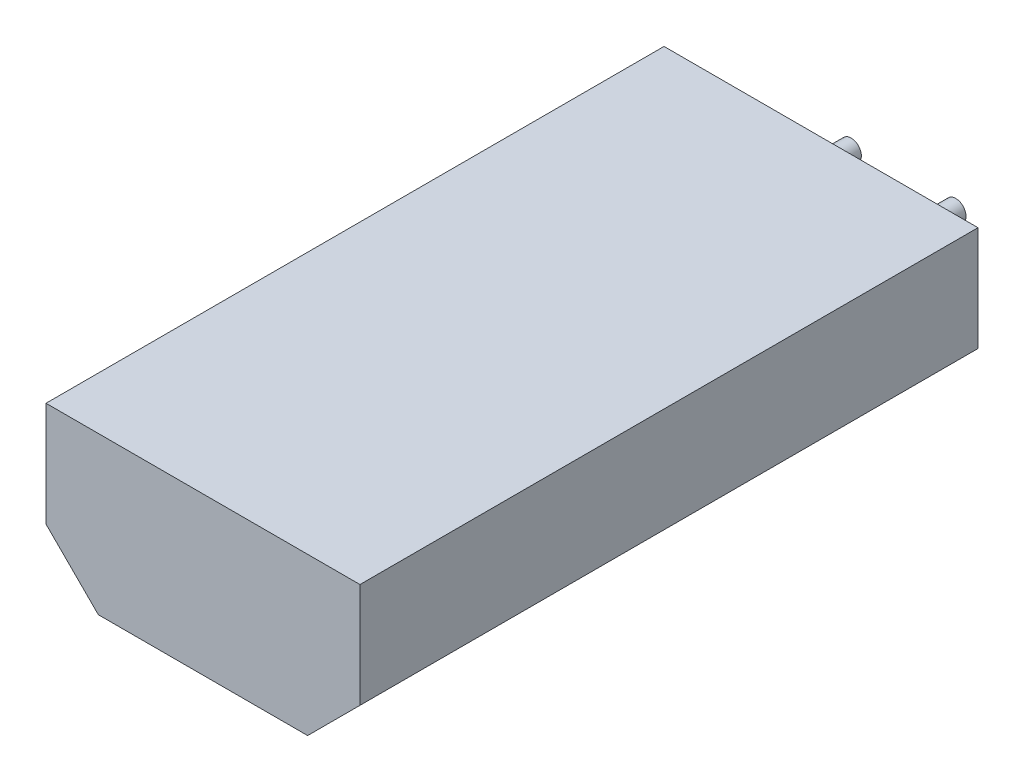
ISO-10303-21;
HEADER;
FILE_DESCRIPTION(('STEP AP214'),'2;1');
FILE_NAME('part.step','',(''),(''),'','','');
FILE_SCHEMA(('AUTOMOTIVE_DESIGN { 1 0 10303 214 1 1 1 1 }'));
ENDSEC;
DATA;
#1=APPLICATION_CONTEXT('core data for automotive mechanical design processes');
#2=APPLICATION_PROTOCOL_DEFINITION('international standard','automotive_design',2000,#1);
#3=PRODUCT_CONTEXT('',#1,'mechanical');
#4=PRODUCT('Part','Part','',(#3));
#5=PRODUCT_RELATED_PRODUCT_CATEGORY('part','',(#4));
#6=PRODUCT_DEFINITION_FORMATION('','',#4);
#7=PRODUCT_DEFINITION_CONTEXT('part definition',#1,'design');
#8=PRODUCT_DEFINITION('design','',#6,#7);
#9=PRODUCT_DEFINITION_SHAPE('','',#8);
#10=(LENGTH_UNIT() NAMED_UNIT(*) SI_UNIT(.MILLI.,.METRE.));
#11=(NAMED_UNIT(*) PLANE_ANGLE_UNIT() SI_UNIT($,.RADIAN.));
#12=(NAMED_UNIT(*) SI_UNIT($,.STERADIAN.) SOLID_ANGLE_UNIT());
#13=UNCERTAINTY_MEASURE_WITH_UNIT(LENGTH_MEASURE(1.E-05),#10,'distance_accuracy_value','');
#14=(GEOMETRIC_REPRESENTATION_CONTEXT(3) GLOBAL_UNCERTAINTY_ASSIGNED_CONTEXT((#13)) GLOBAL_UNIT_ASSIGNED_CONTEXT((#10,
#11,#12)) REPRESENTATION_CONTEXT('',''));
#15=CARTESIAN_POINT('',(0.,0.,0.));
#16=DIRECTION('',(0.,0.,1.));
#17=DIRECTION('',(1.,0.,0.));
#18=AXIS2_PLACEMENT_3D('',#15,#16,#17);
#19=CARTESIAN_POINT('',(2.54,0.,-2.));
#20=DIRECTION('',(0.,0.,1.));
#21=DIRECTION('',(1.,0.,0.));
#22=AXIS2_PLACEMENT_3D('',#19,#20,#21);
#23=CYLINDRICAL_SURFACE('',#22,0.25);
#24=CARTESIAN_POINT('',(2.54,0.,-2.));
#25=DIRECTION('',(0.,0.,1.));
#26=DIRECTION('',(1.,0.,0.));
#27=AXIS2_PLACEMENT_3D('',#24,#25,#26);
#28=CIRCLE('',#27,0.25);
#29=CARTESIAN_POINT('',(2.79,0.,-2.));
#30=VERTEX_POINT('',#29);
#31=EDGE_CURVE('E11',#30,#30,#28,.T.);
#32=ORIENTED_EDGE('',*,*,#31,.T.);
#33=EDGE_LOOP('',(#32));
#34=FACE_BOUND('',#33,.T.);
#35=CARTESIAN_POINT('',(2.54,0.,0.));
#36=DIRECTION('',(0.,0.,1.));
#37=DIRECTION('',(1.,0.,0.));
#38=AXIS2_PLACEMENT_3D('',#35,#36,#37);
#39=CIRCLE('',#38,0.25);
#40=CARTESIAN_POINT('',(2.79,0.,0.));
#41=VERTEX_POINT('',#40);
#42=EDGE_CURVE('E43',#41,#41,#39,.T.);
#43=ORIENTED_EDGE('',*,*,#42,.F.);
#44=EDGE_LOOP('',(#43));
#45=FACE_BOUND('',#44,.T.);
#46=ADVANCED_FACE('F40',(#34,#45),#23,.T.);
#47=CARTESIAN_POINT('',(2.54,0.,-2.));
#48=DIRECTION('',(0.,0.,1.));
#49=DIRECTION('',(1.,0.,0.));
#50=AXIS2_PLACEMENT_3D('',#47,#48,#49);
#51=PLANE('',#50);
#52=ORIENTED_EDGE('',*,*,#31,.F.);
#53=EDGE_LOOP('',(#52));
#54=FACE_BOUND('',#53,.T.);
#55=ADVANCED_FACE('F55',(#54),#51,.F.);
#56=CARTESIAN_POINT('',(2.54,0.,0.));
#57=DIRECTION('',(0.,0.,1.));
#58=DIRECTION('',(1.,0.,0.));
#59=AXIS2_PLACEMENT_3D('',#56,#57,#58);
#60=PLANE('',#59);
#61=ORIENTED_EDGE('',*,*,#42,.T.);
#62=EDGE_LOOP('',(#61));
#63=FACE_BOUND('',#62,.T.);
#64=ADVANCED_FACE('F52',(#63),#60,.T.);
#65=CLOSED_SHELL('',(#46,#55,#64));
#66=MANIFOLD_SOLID_BREP('B2',#65);
#67=CARTESIAN_POINT('',(0.,0.,-2.));
#68=DIRECTION('',(0.,0.,1.));
#69=DIRECTION('',(1.,0.,0.));
#70=AXIS2_PLACEMENT_3D('',#67,#68,#69);
#71=CYLINDRICAL_SURFACE('',#70,0.25);
#72=CARTESIAN_POINT('',(0.,0.,-2.));
#73=DIRECTION('',(0.,0.,1.));
#74=DIRECTION('',(1.,0.,0.));
#75=AXIS2_PLACEMENT_3D('',#72,#73,#74);
#76=CIRCLE('',#75,0.25);
#77=CARTESIAN_POINT('',(0.25,0.,-2.));
#78=VERTEX_POINT('',#77);
#79=EDGE_CURVE('E39',#78,#78,#76,.T.);
#80=ORIENTED_EDGE('',*,*,#79,.T.);
#81=EDGE_LOOP('',(#80));
#82=FACE_BOUND('',#81,.T.);
#83=CARTESIAN_POINT('',(0.,0.,0.));
#84=DIRECTION('',(0.,0.,1.));
#85=DIRECTION('',(1.,0.,0.));
#86=AXIS2_PLACEMENT_3D('',#83,#84,#85);
#87=CIRCLE('',#86,0.25);
#88=CARTESIAN_POINT('',(0.25,0.,0.));
#89=VERTEX_POINT('',#88);
#90=EDGE_CURVE('E93',#89,#89,#87,.T.);
#91=ORIENTED_EDGE('',*,*,#90,.F.);
#92=EDGE_LOOP('',(#91));
#93=FACE_BOUND('',#92,.T.);
#94=ADVANCED_FACE('F90',(#82,#93),#71,.T.);
#95=CARTESIAN_POINT('',(0.,0.,-2.));
#96=DIRECTION('',(0.,0.,1.));
#97=DIRECTION('',(1.,0.,0.));
#98=AXIS2_PLACEMENT_3D('',#95,#96,#97);
#99=PLANE('',#98);
#100=ORIENTED_EDGE('',*,*,#79,.F.);
#101=EDGE_LOOP('',(#100));
#102=FACE_BOUND('',#101,.T.);
#103=ADVANCED_FACE('F105',(#102),#99,.F.);
#104=CARTESIAN_POINT('',(0.,0.,0.));
#105=DIRECTION('',(0.,0.,1.));
#106=DIRECTION('',(1.,0.,0.));
#107=AXIS2_PLACEMENT_3D('',#104,#105,#106);
#108=PLANE('',#107);
#109=ORIENTED_EDGE('',*,*,#90,.T.);
#110=EDGE_LOOP('',(#109));
#111=FACE_BOUND('',#110,.T.);
#112=ADVANCED_FACE('F102',(#111),#108,.T.);
#113=CLOSED_SHELL('',(#94,#103,#112));
#114=MANIFOLD_SOLID_BREP('B6',#113);
#115=CARTESIAN_POINT('',(5.08,1.905,15.));
#116=DIRECTION('',(0.,-1.,0.));
#117=DIRECTION('',(0.,0.,-1.));
#118=AXIS2_PLACEMENT_3D('',#115,#116,#117);
#119=PLANE('',#118);
#120=DIRECTION('',(-1.,0.,0.));
#121=VECTOR('',#120,1.);
#122=CARTESIAN_POINT('',(5.08,1.905,0.));
#123=LINE('',#122,#121);
#124=CARTESIAN_POINT('',(5.08,1.905,0.));
#125=VERTEX_POINT('',#124);
#126=CARTESIAN_POINT('',(-2.54,1.905,0.));
#127=VERTEX_POINT('',#126);
#128=EDGE_CURVE('E215',#125,#127,#123,.T.);
#129=ORIENTED_EDGE('',*,*,#128,.T.);
#130=DIRECTION('',(0.,0.,-1.));
#131=VECTOR('',#130,1.);
#132=CARTESIAN_POINT('',(-2.54,1.905,15.));
#133=LINE('',#132,#131);
#134=CARTESIAN_POINT('',(-2.54,1.905,15.));
#135=VERTEX_POINT('',#134);
#136=EDGE_CURVE('E88',#135,#127,#133,.T.);
#137=ORIENTED_EDGE('',*,*,#136,.F.);
#138=DIRECTION('',(-1.,0.,0.));
#139=VECTOR('',#138,1.);
#140=CARTESIAN_POINT('',(5.08,1.905,15.));
#141=LINE('',#140,#139);
#142=CARTESIAN_POINT('',(5.08,1.905,15.));
#143=VERTEX_POINT('',#142);
#144=EDGE_CURVE('E225',#143,#135,#141,.T.);
#145=ORIENTED_EDGE('',*,*,#144,.F.);
#146=DIRECTION('',(0.,0.,-1.));
#147=VECTOR('',#146,1.);
#148=CARTESIAN_POINT('',(5.08,1.905,15.));
#149=LINE('',#148,#147);
#150=EDGE_CURVE('E211',#143,#125,#149,.T.);
#151=ORIENTED_EDGE('',*,*,#150,.T.);
#152=EDGE_LOOP('',(#129,#137,#145,#151));
#153=FACE_BOUND('',#152,.T.);
#154=ADVANCED_FACE('F131',(#153),#119,.F.);
#155=CARTESIAN_POINT('',(-2.54,1.905,15.));
#156=DIRECTION('',(1.,0.,0.));
#157=DIRECTION('',(0.,0.,-1.));
#158=AXIS2_PLACEMENT_3D('',#155,#156,#157);
#159=PLANE('',#158);
#160=DIRECTION('',(0.,-1.,0.));
#161=VECTOR('',#160,1.);
#162=CARTESIAN_POINT('',(-2.54,1.905,0.));
#163=LINE('',#162,#161);
#164=CARTESIAN_POINT('',(-2.54,-0.635,0.));
#165=VERTEX_POINT('',#164);
#166=EDGE_CURVE('E218',#127,#165,#163,.T.);
#167=ORIENTED_EDGE('',*,*,#166,.T.);
#168=DIRECTION('',(0.,0.,-1.));
#169=VECTOR('',#168,1.);
#170=CARTESIAN_POINT('',(-2.54,-0.635,15.));
#171=LINE('',#170,#169);
#172=CARTESIAN_POINT('',(-2.54,-0.635,15.));
#173=VERTEX_POINT('',#172);
#174=EDGE_CURVE('E139',#173,#165,#171,.T.);
#175=ORIENTED_EDGE('',*,*,#174,.F.);
#176=DIRECTION('',(0.,-1.,0.));
#177=VECTOR('',#176,1.);
#178=CARTESIAN_POINT('',(-2.54,1.905,15.));
#179=LINE('',#178,#177);
#180=EDGE_CURVE('E184',#135,#173,#179,.T.);
#181=ORIENTED_EDGE('',*,*,#180,.F.);
#182=ORIENTED_EDGE('',*,*,#136,.T.);
#183=EDGE_LOOP('',(#167,#175,#181,#182));
#184=FACE_BOUND('',#183,.T.);
#185=ADVANCED_FACE('F249',(#184),#159,.F.);
#186=CARTESIAN_POINT('',(-2.54,-0.635,15.));
#187=DIRECTION('',(0.707106781186547,0.707106781186548,0.));
#188=DIRECTION('',(-0.707106781186548,0.707106781186547,0.));
#189=AXIS2_PLACEMENT_3D('',#186,#187,#188);
#190=PLANE('',#189);
#191=DIRECTION('',(0.707106781186548,-0.707106781186547,0.));
#192=VECTOR('',#191,1.);
#193=CARTESIAN_POINT('',(-2.54,-0.635,0.));
#194=LINE('',#193,#192);
#195=CARTESIAN_POINT('',(-1.27,-1.905,0.));
#196=VERTEX_POINT('',#195);
#197=EDGE_CURVE('E220',#165,#196,#194,.T.);
#198=ORIENTED_EDGE('',*,*,#197,.T.);
#199=DIRECTION('',(0.,0.,-1.));
#200=VECTOR('',#199,1.);
#201=CARTESIAN_POINT('',(-1.27,-1.905,15.));
#202=LINE('',#201,#200);
#203=CARTESIAN_POINT('',(-1.27,-1.905,15.));
#204=VERTEX_POINT('',#203);
#205=EDGE_CURVE('E206',#204,#196,#202,.T.);
#206=ORIENTED_EDGE('',*,*,#205,.F.);
#207=DIRECTION('',(0.707106781186548,-0.707106781186547,0.));
#208=VECTOR('',#207,1.);
#209=CARTESIAN_POINT('',(-2.54,-0.635,15.));
#210=LINE('',#209,#208);
#211=EDGE_CURVE('E197',#173,#204,#210,.T.);
#212=ORIENTED_EDGE('',*,*,#211,.F.);
#213=ORIENTED_EDGE('',*,*,#174,.T.);
#214=EDGE_LOOP('',(#198,#206,#212,#213));
#215=FACE_BOUND('',#214,.T.);
#216=ADVANCED_FACE('F231',(#215),#190,.F.);
#217=CARTESIAN_POINT('',(-1.27,-1.905,15.));
#218=DIRECTION('',(0.,1.,0.));
#219=DIRECTION('',(0.,0.,1.));
#220=AXIS2_PLACEMENT_3D('',#217,#218,#219);
#221=PLANE('',#220);
#222=DIRECTION('',(1.,0.,0.));
#223=VECTOR('',#222,1.);
#224=CARTESIAN_POINT('',(-1.27,-1.905,0.));
#225=LINE('',#224,#223);
#226=CARTESIAN_POINT('',(3.81,-1.905,0.));
#227=VERTEX_POINT('',#226);
#228=EDGE_CURVE('E205',#196,#227,#225,.T.);
#229=ORIENTED_EDGE('',*,*,#228,.T.);
#230=DIRECTION('',(0.,0.,-1.));
#231=VECTOR('',#230,1.);
#232=CARTESIAN_POINT('',(3.81,-1.905,15.));
#233=LINE('',#232,#231);
#234=CARTESIAN_POINT('',(3.81,-1.905,15.));
#235=VERTEX_POINT('',#234);
#236=EDGE_CURVE('E202',#235,#227,#233,.T.);
#237=ORIENTED_EDGE('',*,*,#236,.F.);
#238=DIRECTION('',(1.,0.,0.));
#239=VECTOR('',#238,1.);
#240=CARTESIAN_POINT('',(-1.27,-1.905,15.));
#241=LINE('',#240,#239);
#242=EDGE_CURVE('E191',#204,#235,#241,.T.);
#243=ORIENTED_EDGE('',*,*,#242,.F.);
#244=ORIENTED_EDGE('',*,*,#205,.T.);
#245=EDGE_LOOP('',(#229,#237,#243,#244));
#246=FACE_BOUND('',#245,.T.);
#247=ADVANCED_FACE('F203',(#246),#221,.F.);
#248=CARTESIAN_POINT('',(3.81,-1.905,15.));
#249=DIRECTION('',(-0.707106781186547,0.707106781186548,0.));
#250=DIRECTION('',(-0.707106781186548,-0.707106781186547,0.));
#251=AXIS2_PLACEMENT_3D('',#248,#249,#250);
#252=PLANE('',#251);
#253=DIRECTION('',(0.707106781186548,0.707106781186547,0.));
#254=VECTOR('',#253,1.);
#255=CARTESIAN_POINT('',(3.81,-1.905,0.));
#256=LINE('',#255,#254);
#257=CARTESIAN_POINT('',(5.08,-0.635,0.));
#258=VERTEX_POINT('',#257);
#259=EDGE_CURVE('E170',#227,#258,#256,.T.);
#260=ORIENTED_EDGE('',*,*,#259,.T.);
#261=DIRECTION('',(0.,0.,-1.));
#262=VECTOR('',#261,1.);
#263=CARTESIAN_POINT('',(5.08,-0.635,15.));
#264=LINE('',#263,#262);
#265=CARTESIAN_POINT('',(5.08,-0.635,15.));
#266=VERTEX_POINT('',#265);
#267=EDGE_CURVE('E207',#266,#258,#264,.T.);
#268=ORIENTED_EDGE('',*,*,#267,.F.);
#269=DIRECTION('',(0.707106781186548,0.707106781186547,0.));
#270=VECTOR('',#269,1.);
#271=CARTESIAN_POINT('',(3.81,-1.905,15.));
#272=LINE('',#271,#270);
#273=EDGE_CURVE('E195',#235,#266,#272,.T.);
#274=ORIENTED_EDGE('',*,*,#273,.F.);
#275=ORIENTED_EDGE('',*,*,#236,.T.);
#276=EDGE_LOOP('',(#260,#268,#274,#275));
#277=FACE_BOUND('',#276,.T.);
#278=ADVANCED_FACE('F209',(#277),#252,.F.);
#279=CARTESIAN_POINT('',(5.08,-0.635,15.));
#280=DIRECTION('',(-1.,0.,0.));
#281=DIRECTION('',(0.,0.,1.));
#282=AXIS2_PLACEMENT_3D('',#279,#280,#281);
#283=PLANE('',#282);
#284=DIRECTION('',(0.,1.,0.));
#285=VECTOR('',#284,1.);
#286=CARTESIAN_POINT('',(5.08,-0.635,0.));
#287=LINE('',#286,#285);
#288=EDGE_CURVE('E176',#258,#125,#287,.T.);
#289=ORIENTED_EDGE('',*,*,#288,.T.);
#290=ORIENTED_EDGE('',*,*,#150,.F.);
#291=DIRECTION('',(0.,1.,0.));
#292=VECTOR('',#291,1.);
#293=CARTESIAN_POINT('',(5.08,-0.635,15.));
#294=LINE('',#293,#292);
#295=EDGE_CURVE('E147',#266,#143,#294,.T.);
#296=ORIENTED_EDGE('',*,*,#295,.F.);
#297=ORIENTED_EDGE('',*,*,#267,.T.);
#298=EDGE_LOOP('',(#289,#290,#296,#297));
#299=FACE_BOUND('',#298,.T.);
#300=ADVANCED_FACE('F238',(#299),#283,.F.);
#301=CARTESIAN_POINT('',(0.,0.,15.));
#302=DIRECTION('',(0.,0.,1.));
#303=DIRECTION('',(1.,0.,0.));
#304=AXIS2_PLACEMENT_3D('',#301,#302,#303);
#305=PLANE('',#304);
#306=ORIENTED_EDGE('',*,*,#144,.T.);
#307=ORIENTED_EDGE('',*,*,#180,.T.);
#308=ORIENTED_EDGE('',*,*,#211,.T.);
#309=ORIENTED_EDGE('',*,*,#242,.T.);
#310=ORIENTED_EDGE('',*,*,#273,.T.);
#311=ORIENTED_EDGE('',*,*,#295,.T.);
#312=EDGE_LOOP('',(#306,#307,#308,#309,#310,#311));
#313=FACE_BOUND('',#312,.T.);
#314=ADVANCED_FACE('F193',(#313),#305,.T.);
#315=CARTESIAN_POINT('',(0.,0.,0.));
#316=DIRECTION('',(0.,0.,1.));
#317=DIRECTION('',(1.,0.,0.));
#318=AXIS2_PLACEMENT_3D('',#315,#316,#317);
#319=PLANE('',#318);
#320=ORIENTED_EDGE('',*,*,#128,.F.);
#321=ORIENTED_EDGE('',*,*,#288,.F.);
#322=ORIENTED_EDGE('',*,*,#259,.F.);
#323=ORIENTED_EDGE('',*,*,#228,.F.);
#324=ORIENTED_EDGE('',*,*,#197,.F.);
#325=ORIENTED_EDGE('',*,*,#166,.F.);
#326=EDGE_LOOP('',(#320,#321,#322,#323,#324,#325));
#327=FACE_BOUND('',#326,.T.);
#328=ADVANCED_FACE('F234',(#327),#319,.F.);
#329=CLOSED_SHELL('',(#154,#185,#216,#247,#278,#300,#314,#328));
#330=MANIFOLD_SOLID_BREP('B34',#329);
#331=ADVANCED_BREP_SHAPE_REPRESENTATION('',(#18,#66,#114,#330),#14);
#332=SHAPE_DEFINITION_REPRESENTATION(#9,#331);
ENDSEC;
END-ISO-10303-21;
